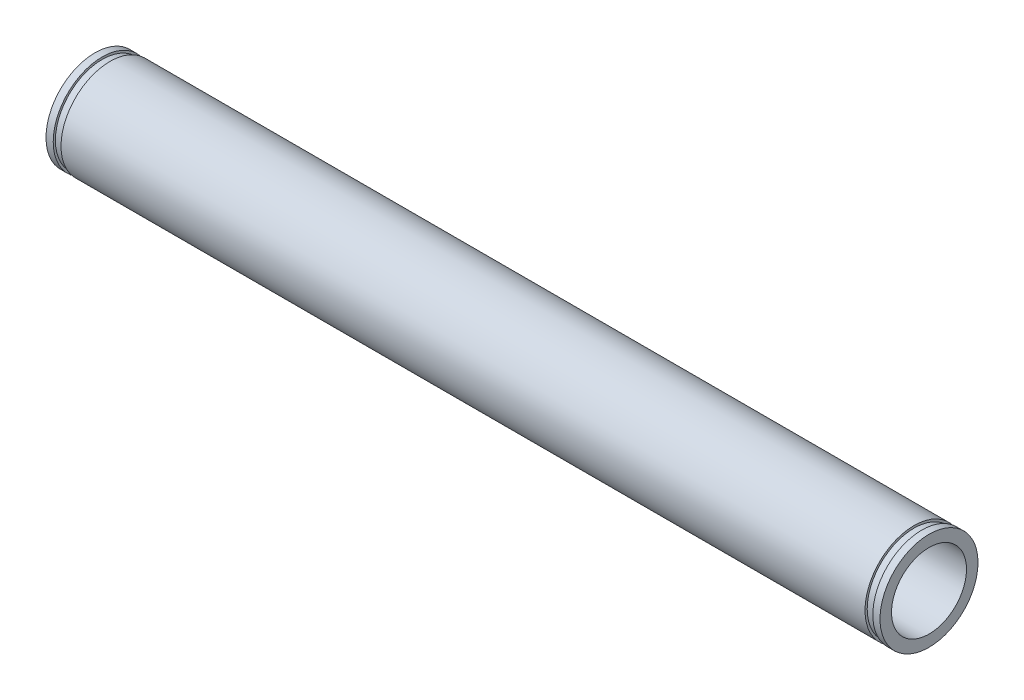
ISO-10303-21;
HEADER;
FILE_DESCRIPTION(('STEP AP214'),'2;1');
FILE_NAME('part.step','',(''),(''),'','','');
FILE_SCHEMA(('AUTOMOTIVE_DESIGN { 1 0 10303 214 1 1 1 1 }'));
ENDSEC;
DATA;
#1=APPLICATION_CONTEXT('core data for automotive mechanical design processes');
#2=APPLICATION_PROTOCOL_DEFINITION('international standard','automotive_design',2000,#1);
#3=PRODUCT_CONTEXT('',#1,'mechanical');
#4=PRODUCT('Part','Part','',(#3));
#5=PRODUCT_RELATED_PRODUCT_CATEGORY('part','',(#4));
#6=PRODUCT_DEFINITION_FORMATION('','',#4);
#7=PRODUCT_DEFINITION_CONTEXT('part definition',#1,'design');
#8=PRODUCT_DEFINITION('design','',#6,#7);
#9=PRODUCT_DEFINITION_SHAPE('','',#8);
#10=(LENGTH_UNIT() NAMED_UNIT(*) SI_UNIT(.MILLI.,.METRE.));
#11=(NAMED_UNIT(*) PLANE_ANGLE_UNIT() SI_UNIT($,.RADIAN.));
#12=(NAMED_UNIT(*) SI_UNIT($,.STERADIAN.) SOLID_ANGLE_UNIT());
#13=UNCERTAINTY_MEASURE_WITH_UNIT(LENGTH_MEASURE(1.E-05),#10,'distance_accuracy_value','');
#14=(GEOMETRIC_REPRESENTATION_CONTEXT(3) GLOBAL_UNCERTAINTY_ASSIGNED_CONTEXT((#13)) GLOBAL_UNIT_ASSIGNED_CONTEXT((#10,
#11,#12)) REPRESENTATION_CONTEXT('',''));
#15=CARTESIAN_POINT('',(0.,0.,0.));
#16=DIRECTION('',(0.,0.,1.));
#17=DIRECTION('',(1.,0.,0.));
#18=AXIS2_PLACEMENT_3D('',#15,#16,#17);
#19=CARTESIAN_POINT('',(52.959,0.,0.));
#20=DIRECTION('',(-1.,0.,0.));
#21=DIRECTION('',(0.,0.,1.));
#22=AXIS2_PLACEMENT_3D('',#19,#20,#21);
#23=CYLINDRICAL_SURFACE('',#22,6.223);
#24=CARTESIAN_POINT('',(-51.054,0.,0.));
#25=DIRECTION('',(-1.,0.,0.));
#26=DIRECTION('',(0.,0.,1.));
#27=AXIS2_PLACEMENT_3D('',#24,#25,#26);
#28=CIRCLE('',#27,6.223);
#29=CARTESIAN_POINT('',(-51.054,0.,6.223));
#30=VERTEX_POINT('',#29);
#31=EDGE_CURVE('E51',#30,#30,#28,.T.);
#32=ORIENTED_EDGE('',*,*,#31,.F.);
#33=EDGE_LOOP('',(#32));
#34=FACE_BOUND('',#33,.T.);
#35=CARTESIAN_POINT('',(51.054,0.,0.));
#36=DIRECTION('',(1.,0.,0.));
#37=DIRECTION('',(0.,0.,-1.));
#38=AXIS2_PLACEMENT_3D('',#35,#36,#37);
#39=CIRCLE('',#38,6.223);
#40=CARTESIAN_POINT('',(51.054,0.,-6.223));
#41=VERTEX_POINT('',#40);
#42=EDGE_CURVE('E57',#41,#41,#39,.T.);
#43=ORIENTED_EDGE('',*,*,#42,.F.);
#44=EDGE_LOOP('',(#43));
#45=FACE_BOUND('',#44,.T.);
#46=ADVANCED_FACE('F32',(#34,#45),#23,.T.);
#47=CARTESIAN_POINT('',(52.0446,0.,0.));
#48=DIRECTION('',(1.,0.,0.));
#49=DIRECTION('',(0.,0.,-1.));
#50=AXIS2_PLACEMENT_3D('',#47,#48,#49);
#51=CIRCLE('',#50,6.223);
#52=CARTESIAN_POINT('',(52.0446,0.,-6.223));
#53=VERTEX_POINT('',#52);
#54=EDGE_CURVE('E36',#53,#53,#51,.T.);
#55=ORIENTED_EDGE('',*,*,#54,.T.);
#56=EDGE_LOOP('',(#55));
#57=FACE_BOUND('',#56,.T.);
#58=CARTESIAN_POINT('',(52.959,0.,0.));
#59=DIRECTION('',(1.,0.,0.));
#60=DIRECTION('',(0.,0.,-1.));
#61=AXIS2_PLACEMENT_3D('',#58,#59,#60);
#62=CIRCLE('',#61,6.223);
#63=CARTESIAN_POINT('',(52.959,0.,-6.223));
#64=VERTEX_POINT('',#63);
#65=EDGE_CURVE('E10',#64,#64,#62,.T.);
#66=ORIENTED_EDGE('',*,*,#65,.F.);
#67=EDGE_LOOP('',(#66));
#68=FACE_BOUND('',#67,.T.);
#69=ADVANCED_FACE('F95',(#57,#68),#23,.T.);
#70=CARTESIAN_POINT('',(52.959,0.,0.));
#71=DIRECTION('',(1.,0.,0.));
#72=DIRECTION('',(0.,0.,-1.));
#73=AXIS2_PLACEMENT_3D('',#70,#71,#72);
#74=PLANE('',#73);
#75=ORIENTED_EDGE('',*,*,#65,.T.);
#76=EDGE_LOOP('',(#75));
#77=FACE_BOUND('',#76,.T.);
#78=CARTESIAN_POINT('',(52.959,0.,0.));
#79=DIRECTION('',(1.,0.,0.));
#80=DIRECTION('',(0.,0.,-1.));
#81=AXIS2_PLACEMENT_3D('',#78,#79,#80);
#82=CIRCLE('',#81,4.7625);
#83=CARTESIAN_POINT('',(52.959,0.,-4.7625));
#84=VERTEX_POINT('',#83);
#85=EDGE_CURVE('E45',#84,#84,#82,.T.);
#86=ORIENTED_EDGE('',*,*,#85,.F.);
#87=EDGE_LOOP('',(#86));
#88=FACE_BOUND('',#87,.T.);
#89=ADVANCED_FACE('F103',(#77,#88),#74,.T.);
#90=CARTESIAN_POINT('',(-52.959,0.,0.));
#91=DIRECTION('',(1.,0.,0.));
#92=DIRECTION('',(0.,0.,-1.));
#93=AXIS2_PLACEMENT_3D('',#90,#91,#92);
#94=PLANE('',#93);
#95=CARTESIAN_POINT('',(-52.959,0.,0.));
#96=DIRECTION('',(1.,0.,0.));
#97=DIRECTION('',(0.,0.,-1.));
#98=AXIS2_PLACEMENT_3D('',#95,#96,#97);
#99=CIRCLE('',#98,6.223);
#100=CARTESIAN_POINT('',(-52.959,0.,-6.223));
#101=VERTEX_POINT('',#100);
#102=EDGE_CURVE('E40',#101,#101,#99,.T.);
#103=ORIENTED_EDGE('',*,*,#102,.F.);
#104=EDGE_LOOP('',(#103));
#105=FACE_BOUND('',#104,.T.);
#106=CARTESIAN_POINT('',(-52.959,0.,0.));
#107=DIRECTION('',(1.,0.,0.));
#108=DIRECTION('',(0.,0.,-1.));
#109=AXIS2_PLACEMENT_3D('',#106,#107,#108);
#110=CIRCLE('',#109,4.7625);
#111=CARTESIAN_POINT('',(-52.959,0.,-4.7625));
#112=VERTEX_POINT('',#111);
#113=EDGE_CURVE('E48',#112,#112,#110,.T.);
#114=ORIENTED_EDGE('',*,*,#113,.T.);
#115=EDGE_LOOP('',(#114));
#116=FACE_BOUND('',#115,.T.);
#117=ADVANCED_FACE('F81',(#105,#116),#94,.F.);
#118=CARTESIAN_POINT('',(-52.0446,0.,0.));
#119=DIRECTION('',(-1.,0.,0.));
#120=DIRECTION('',(0.,0.,1.));
#121=AXIS2_PLACEMENT_3D('',#118,#119,#120);
#122=CIRCLE('',#121,6.223);
#123=CARTESIAN_POINT('',(-52.0446,0.,6.223));
#124=VERTEX_POINT('',#123);
#125=EDGE_CURVE('E54',#124,#124,#122,.T.);
#126=ORIENTED_EDGE('',*,*,#125,.T.);
#127=EDGE_LOOP('',(#126));
#128=FACE_BOUND('',#127,.T.);
#129=ORIENTED_EDGE('',*,*,#102,.T.);
#130=EDGE_LOOP('',(#129));
#131=FACE_BOUND('',#130,.T.);
#132=ADVANCED_FACE('F34',(#128,#131),#23,.T.);
#133=CARTESIAN_POINT('',(52.959,0.,0.));
#134=DIRECTION('',(-1.,0.,0.));
#135=DIRECTION('',(0.,0.,1.));
#136=AXIS2_PLACEMENT_3D('',#133,#134,#135);
#137=CYLINDRICAL_SURFACE('',#136,4.7625);
#138=ORIENTED_EDGE('',*,*,#85,.T.);
#139=EDGE_LOOP('',(#138));
#140=FACE_BOUND('',#139,.T.);
#141=ORIENTED_EDGE('',*,*,#113,.F.);
#142=EDGE_LOOP('',(#141));
#143=FACE_BOUND('',#142,.T.);
#144=ADVANCED_FACE('F83',(#140,#143),#137,.F.);
#145=CARTESIAN_POINT('',(-52.0446,0.,0.));
#146=DIRECTION('',(-1.,0.,0.));
#147=DIRECTION('',(0.,0.,1.));
#148=AXIS2_PLACEMENT_3D('',#145,#146,#147);
#149=PLANE('',#148);
#150=CARTESIAN_POINT('',(-52.0446,0.,0.));
#151=DIRECTION('',(-1.,0.,0.));
#152=DIRECTION('',(0.,0.,1.));
#153=AXIS2_PLACEMENT_3D('',#150,#151,#152);
#154=CIRCLE('',#153,5.9436);
#155=CARTESIAN_POINT('',(-52.0446,0.,5.9436));
#156=VERTEX_POINT('',#155);
#157=EDGE_CURVE('E55',#156,#156,#154,.T.);
#158=ORIENTED_EDGE('',*,*,#157,.T.);
#159=EDGE_LOOP('',(#158));
#160=FACE_BOUND('',#159,.T.);
#161=ORIENTED_EDGE('',*,*,#125,.F.);
#162=EDGE_LOOP('',(#161));
#163=FACE_BOUND('',#162,.T.);
#164=ADVANCED_FACE('F85',(#160,#163),#149,.F.);
#165=CARTESIAN_POINT('',(-51.054,0.,0.));
#166=DIRECTION('',(-1.,0.,0.));
#167=DIRECTION('',(0.,0.,1.));
#168=AXIS2_PLACEMENT_3D('',#165,#166,#167);
#169=PLANE('',#168);
#170=CARTESIAN_POINT('',(-51.054,0.,0.));
#171=DIRECTION('',(-1.,0.,0.));
#172=DIRECTION('',(0.,0.,1.));
#173=AXIS2_PLACEMENT_3D('',#170,#171,#172);
#174=CIRCLE('',#173,5.9436);
#175=CARTESIAN_POINT('',(-51.054,0.,5.9436));
#176=VERTEX_POINT('',#175);
#177=EDGE_CURVE('E63',#176,#176,#174,.T.);
#178=ORIENTED_EDGE('',*,*,#177,.F.);
#179=EDGE_LOOP('',(#178));
#180=FACE_BOUND('',#179,.T.);
#181=ORIENTED_EDGE('',*,*,#31,.T.);
#182=EDGE_LOOP('',(#181));
#183=FACE_BOUND('',#182,.T.);
#184=ADVANCED_FACE('F91',(#180,#183),#169,.T.);
#185=CARTESIAN_POINT('',(-52.0446,0.,0.));
#186=DIRECTION('',(1.,0.,0.));
#187=DIRECTION('',(0.,0.,-1.));
#188=AXIS2_PLACEMENT_3D('',#185,#186,#187);
#189=CYLINDRICAL_SURFACE('',#188,5.9436);
#190=ORIENTED_EDGE('',*,*,#157,.F.);
#191=EDGE_LOOP('',(#190));
#192=FACE_BOUND('',#191,.T.);
#193=ORIENTED_EDGE('',*,*,#177,.T.);
#194=EDGE_LOOP('',(#193));
#195=FACE_BOUND('',#194,.T.);
#196=ADVANCED_FACE('F109',(#192,#195),#189,.T.);
#197=CARTESIAN_POINT('',(52.0446,0.,0.));
#198=DIRECTION('',(1.,0.,0.));
#199=DIRECTION('',(0.,0.,1.));
#200=AXIS2_PLACEMENT_3D('',#197,#198,#199);
#201=PLANE('',#200);
#202=CARTESIAN_POINT('',(52.0446,0.,0.));
#203=DIRECTION('',(-1.,0.,0.));
#204=DIRECTION('',(0.,0.,1.));
#205=AXIS2_PLACEMENT_3D('',#202,#203,#204);
#206=CIRCLE('',#205,5.9436);
#207=CARTESIAN_POINT('',(52.0446,0.,5.9436));
#208=VERTEX_POINT('',#207);
#209=EDGE_CURVE('E59',#208,#208,#206,.T.);
#210=ORIENTED_EDGE('',*,*,#209,.F.);
#211=EDGE_LOOP('',(#210));
#212=FACE_BOUND('',#211,.T.);
#213=ORIENTED_EDGE('',*,*,#54,.F.);
#214=EDGE_LOOP('',(#213));
#215=FACE_BOUND('',#214,.T.);
#216=ADVANCED_FACE('F114',(#212,#215),#201,.F.);
#217=CARTESIAN_POINT('',(51.054,0.,0.));
#218=DIRECTION('',(1.,0.,0.));
#219=DIRECTION('',(0.,0.,1.));
#220=AXIS2_PLACEMENT_3D('',#217,#218,#219);
#221=PLANE('',#220);
#222=CARTESIAN_POINT('',(51.054,0.,0.));
#223=DIRECTION('',(-1.,0.,0.));
#224=DIRECTION('',(0.,0.,1.));
#225=AXIS2_PLACEMENT_3D('',#222,#223,#224);
#226=CIRCLE('',#225,5.9436);
#227=CARTESIAN_POINT('',(51.054,0.,5.9436));
#228=VERTEX_POINT('',#227);
#229=EDGE_CURVE('E65',#228,#228,#226,.T.);
#230=ORIENTED_EDGE('',*,*,#229,.T.);
#231=EDGE_LOOP('',(#230));
#232=FACE_BOUND('',#231,.T.);
#233=ORIENTED_EDGE('',*,*,#42,.T.);
#234=EDGE_LOOP('',(#233));
#235=FACE_BOUND('',#234,.T.);
#236=ADVANCED_FACE('F119',(#232,#235),#221,.T.);
#237=CARTESIAN_POINT('',(52.0446,0.,0.));
#238=DIRECTION('',(-1.,0.,0.));
#239=DIRECTION('',(0.,0.,1.));
#240=AXIS2_PLACEMENT_3D('',#237,#238,#239);
#241=CYLINDRICAL_SURFACE('',#240,5.9436);
#242=ORIENTED_EDGE('',*,*,#209,.T.);
#243=EDGE_LOOP('',(#242));
#244=FACE_BOUND('',#243,.T.);
#245=ORIENTED_EDGE('',*,*,#229,.F.);
#246=EDGE_LOOP('',(#245));
#247=FACE_BOUND('',#246,.T.);
#248=ADVANCED_FACE('F122',(#244,#247),#241,.T.);
#249=CLOSED_SHELL('',(#46,#69,#89,#117,#132,#144,#164,#184,#196,#216,#236,#248));
#250=MANIFOLD_SOLID_BREP('B2',#249);
#251=ADVANCED_BREP_SHAPE_REPRESENTATION('',(#18,#250),#14);
#252=SHAPE_DEFINITION_REPRESENTATION(#9,#251);
ENDSEC;
END-ISO-10303-21;
